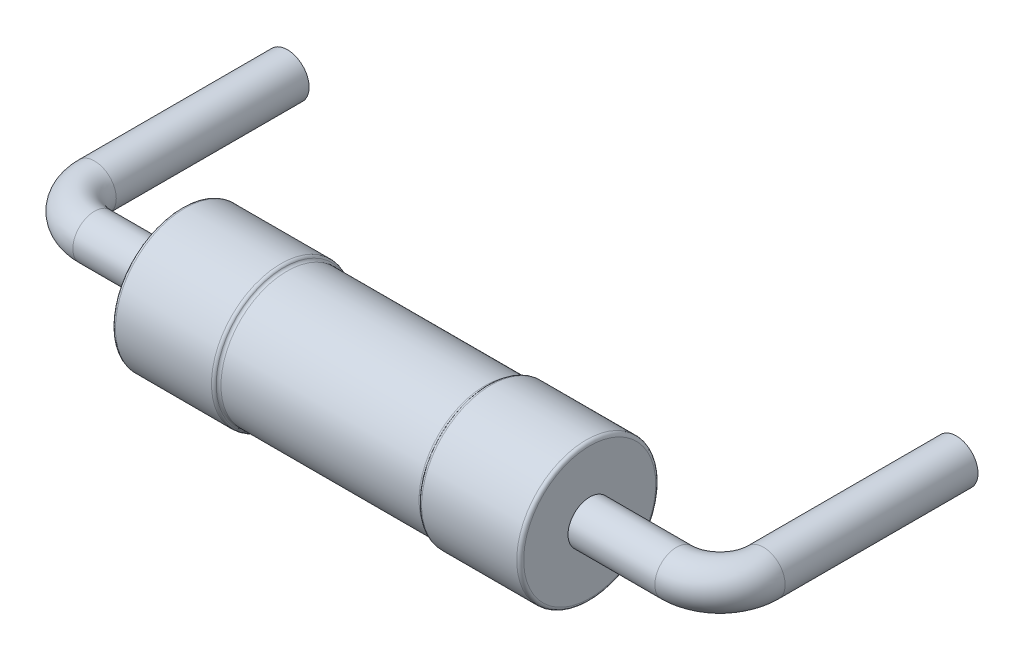
ISO-10303-21;
HEADER;
FILE_DESCRIPTION(('STEP AP214'),'2;1');
FILE_NAME('part.step','',(''),(''),'','','');
FILE_SCHEMA(('AUTOMOTIVE_DESIGN { 1 0 10303 214 1 1 1 1 }'));
ENDSEC;
DATA;
#1=APPLICATION_CONTEXT('core data for automotive mechanical design processes');
#2=APPLICATION_PROTOCOL_DEFINITION('international standard','automotive_design',2000,#1);
#3=PRODUCT_CONTEXT('',#1,'mechanical');
#4=PRODUCT('Part','Part','',(#3));
#5=PRODUCT_RELATED_PRODUCT_CATEGORY('part','',(#4));
#6=PRODUCT_DEFINITION_FORMATION('','',#4);
#7=PRODUCT_DEFINITION_CONTEXT('part definition',#1,'design');
#8=PRODUCT_DEFINITION('design','',#6,#7);
#9=PRODUCT_DEFINITION_SHAPE('','',#8);
#10=(LENGTH_UNIT() NAMED_UNIT(*) SI_UNIT(.MILLI.,.METRE.));
#11=(NAMED_UNIT(*) PLANE_ANGLE_UNIT() SI_UNIT($,.RADIAN.));
#12=(NAMED_UNIT(*) SI_UNIT($,.STERADIAN.) SOLID_ANGLE_UNIT());
#13=UNCERTAINTY_MEASURE_WITH_UNIT(LENGTH_MEASURE(1.E-05),#10,'distance_accuracy_value','');
#14=(GEOMETRIC_REPRESENTATION_CONTEXT(3) GLOBAL_UNCERTAINTY_ASSIGNED_CONTEXT((#13)) GLOBAL_UNIT_ASSIGNED_CONTEXT((#10,
#11,#12)) REPRESENTATION_CONTEXT('',''));
#15=CARTESIAN_POINT('',(0.,0.,0.));
#16=DIRECTION('',(0.,0.,1.));
#17=DIRECTION('',(1.,0.,0.));
#18=AXIS2_PLACEMENT_3D('',#15,#16,#17);
#19=CARTESIAN_POINT('',(-3.599,-0.251,0.));
#20=DIRECTION('',(0.,0.,-1.));
#21=DIRECTION('',(-1.,0.,0.));
#22=AXIS2_PLACEMENT_3D('',#19,#20,#21);
#23=PLANE('',#22);
#24=CARTESIAN_POINT('',(-3.85,0.,0.));
#25=DIRECTION('',(0.,0.,-1.));
#26=DIRECTION('',(-1.,0.,0.));
#27=AXIS2_PLACEMENT_3D('',#24,#25,#26);
#28=CIRCLE('',#27,0.25);
#29=CARTESIAN_POINT('',(-4.1,0.,0.));
#30=VERTEX_POINT('',#29);
#31=EDGE_CURVE('E73',#30,#30,#28,.F.);
#32=ORIENTED_EDGE('',*,*,#31,.F.);
#33=EDGE_LOOP('',(#32));
#34=FACE_BOUND('',#33,.T.);
#35=ADVANCED_FACE('F14',(#34),#23,.T.);
#36=CARTESIAN_POINT('',(-3.85,0.,2.22));
#37=DIRECTION('',(0.,0.,-1.));
#38=DIRECTION('',(-1.,0.,0.));
#39=AXIS2_PLACEMENT_3D('',#36,#37,#38);
#40=CYLINDRICAL_SURFACE('',#39,0.25);
#41=ORIENTED_EDGE('',*,*,#31,.T.);
#42=EDGE_LOOP('',(#41));
#43=FACE_BOUND('',#42,.T.);
#44=CARTESIAN_POINT('',(-3.85,0.,2.22));
#45=DIRECTION('',(0.,0.,1.));
#46=DIRECTION('',(1.,0.,0.));
#47=AXIS2_PLACEMENT_3D('',#44,#45,#46);
#48=CIRCLE('',#47,0.25);
#49=CARTESIAN_POINT('',(-3.6,0.,2.22));
#50=VERTEX_POINT('',#49);
#51=EDGE_CURVE('E69',#50,#50,#48,.T.);
#52=ORIENTED_EDGE('',*,*,#51,.F.);
#53=EDGE_LOOP('',(#52));
#54=FACE_BOUND('',#53,.T.);
#55=ADVANCED_FACE('F94',(#43,#54),#40,.T.);
#56=CARTESIAN_POINT('',(-3.35,0.,2.22));
#57=DIRECTION('',(0.,1.,0.));
#58=DIRECTION('',(0.,0.,1.));
#59=AXIS2_PLACEMENT_3D('',#56,#57,#58);
#60=TOROIDAL_SURFACE('',#59,0.5,0.25);
#61=ORIENTED_EDGE('',*,*,#51,.T.);
#62=EDGE_LOOP('',(#61));
#63=FACE_BOUND('',#62,.T.);
#64=CARTESIAN_POINT('',(-3.35,0.,2.72));
#65=DIRECTION('',(1.,0.,0.));
#66=DIRECTION('',(0.,0.,-1.));
#67=AXIS2_PLACEMENT_3D('',#64,#65,#66);
#68=CIRCLE('',#67,0.25);
#69=CARTESIAN_POINT('',(-3.35,0.,2.47));
#70=VERTEX_POINT('',#69);
#71=EDGE_CURVE('E72',#70,#70,#68,.T.);
#72=ORIENTED_EDGE('',*,*,#71,.F.);
#73=EDGE_LOOP('',(#72));
#74=FACE_BOUND('',#73,.T.);
#75=ADVANCED_FACE('F92',(#63,#74),#60,.T.);
#76=CARTESIAN_POINT('',(-2.35,0.,2.72));
#77=DIRECTION('',(-1.,0.,0.));
#78=DIRECTION('',(0.,0.,1.));
#79=AXIS2_PLACEMENT_3D('',#76,#77,#78);
#80=CYLINDRICAL_SURFACE('',#79,0.25);
#81=ORIENTED_EDGE('',*,*,#71,.T.);
#82=EDGE_LOOP('',(#81));
#83=FACE_BOUND('',#82,.T.);
#84=CARTESIAN_POINT('',(-2.35,0.,2.72));
#85=DIRECTION('',(-1.,0.,0.));
#86=DIRECTION('',(0.,0.,1.));
#87=AXIS2_PLACEMENT_3D('',#84,#85,#86);
#88=CIRCLE('',#87,0.25);
#89=CARTESIAN_POINT('',(-2.35,0.,2.97));
#90=VERTEX_POINT('',#89);
#91=EDGE_CURVE('E82',#90,#90,#88,.F.);
#92=ORIENTED_EDGE('',*,*,#91,.F.);
#93=EDGE_LOOP('',(#92));
#94=FACE_BOUND('',#93,.T.);
#95=ADVANCED_FACE('F89',(#83,#94),#80,.T.);
#96=CARTESIAN_POINT('',(-2.35,-0.761,1.959));
#97=DIRECTION('',(-1.,0.,0.));
#98=DIRECTION('',(0.,0.,1.));
#99=AXIS2_PLACEMENT_3D('',#96,#97,#98);
#100=PLANE('',#99);
#101=ORIENTED_EDGE('',*,*,#91,.T.);
#102=EDGE_LOOP('',(#101));
#103=FACE_BOUND('',#102,.T.);
#104=CARTESIAN_POINT('',(-2.35,0.,2.72));
#105=DIRECTION('',(-1.,0.,0.));
#106=DIRECTION('',(0.,0.,1.));
#107=AXIS2_PLACEMENT_3D('',#104,#105,#106);
#108=CIRCLE('',#107,0.760000000001124);
#109=CARTESIAN_POINT('',(-2.35,0.,3.48000000000112));
#110=VERTEX_POINT('',#109);
#111=EDGE_CURVE('E68',#110,#110,#108,.F.);
#112=ORIENTED_EDGE('',*,*,#111,.F.);
#113=EDGE_LOOP('',(#112));
#114=FACE_BOUND('',#113,.T.);
#115=ADVANCED_FACE('F102',(#103,#114),#100,.T.);
#116=CARTESIAN_POINT('',(-2.31,0.,2.72));
#117=DIRECTION('',(-1.,0.,0.));
#118=DIRECTION('',(0.,0.,1.));
#119=AXIS2_PLACEMENT_3D('',#116,#117,#118);
#120=TOROIDAL_SURFACE('',#119,0.76,0.0399999999999999);
#121=CARTESIAN_POINT('',(-2.31,0.,2.72));
#122=DIRECTION('',(1.,0.,0.));
#123=DIRECTION('',(0.,0.,-1.));
#124=AXIS2_PLACEMENT_3D('',#121,#122,#123);
#125=CIRCLE('',#124,0.8);
#126=CARTESIAN_POINT('',(-2.31,0.,1.92));
#127=VERTEX_POINT('',#126);
#128=EDGE_CURVE('E63',#127,#127,#125,.T.);
#129=ORIENTED_EDGE('',*,*,#128,.F.);
#130=EDGE_LOOP('',(#129));
#131=FACE_BOUND('',#130,.T.);
#132=ORIENTED_EDGE('',*,*,#111,.T.);
#133=EDGE_LOOP('',(#132));
#134=FACE_BOUND('',#133,.T.);
#135=ADVANCED_FACE('F160',(#131,#134),#120,.T.);
#136=CARTESIAN_POINT('',(-1.20428203230276,0.,2.72));
#137=DIRECTION('',(-1.,0.,0.));
#138=DIRECTION('',(0.,0.,1.));
#139=AXIS2_PLACEMENT_3D('',#136,#137,#138);
#140=CYLINDRICAL_SURFACE('',#139,0.8);
#141=ORIENTED_EDGE('',*,*,#128,.T.);
#142=EDGE_LOOP('',(#141));
#143=FACE_BOUND('',#142,.T.);
#144=CARTESIAN_POINT('',(-1.20428203230276,0.,2.72));
#145=DIRECTION('',(1.,0.,0.));
#146=DIRECTION('',(0.,0.,-1.));
#147=AXIS2_PLACEMENT_3D('',#144,#145,#146);
#148=CIRCLE('',#147,0.8);
#149=CARTESIAN_POINT('',(-1.20428203230276,0.,1.92));
#150=VERTEX_POINT('',#149);
#151=EDGE_CURVE('E60',#150,#150,#148,.T.);
#152=ORIENTED_EDGE('',*,*,#151,.F.);
#153=EDGE_LOOP('',(#152));
#154=FACE_BOUND('',#153,.T.);
#155=ADVANCED_FACE('F156',(#143,#154),#140,.T.);
#156=CARTESIAN_POINT('',(-1.20428203230276,0.,2.72));
#157=DIRECTION('',(1.,0.,0.));
#158=DIRECTION('',(0.,0.,-1.));
#159=AXIS2_PLACEMENT_3D('',#156,#157,#158);
#160=TOROIDAL_SURFACE('',#159,0.760000000000002,0.0400000000000002);
#161=ORIENTED_EDGE('',*,*,#151,.T.);
#162=EDGE_LOOP('',(#161));
#163=FACE_BOUND('',#162,.T.);
#164=CARTESIAN_POINT('',(-1.16964101615138,0.,2.72));
#165=DIRECTION('',(1.,0.,0.));
#166=DIRECTION('',(0.,0.,-1.));
#167=AXIS2_PLACEMENT_3D('',#164,#165,#166);
#168=CIRCLE('',#167,0.780000000000001);
#169=CARTESIAN_POINT('',(-1.16964101615138,0.,1.94));
#170=VERTEX_POINT('',#169);
#171=EDGE_CURVE('E57',#170,#170,#168,.T.);
#172=ORIENTED_EDGE('',*,*,#171,.F.);
#173=EDGE_LOOP('',(#172));
#174=FACE_BOUND('',#173,.T.);
#175=ADVANCED_FACE('F152',(#163,#174),#160,.T.);
#176=CARTESIAN_POINT('',(-1.135,0.,2.72));
#177=DIRECTION('',(-1.,0.,0.));
#178=DIRECTION('',(0.,0.,1.));
#179=AXIS2_PLACEMENT_3D('',#176,#177,#178);
#180=TOROIDAL_SURFACE('',#179,0.799999999999998,0.0399999999999991);
#181=CARTESIAN_POINT('',(-1.135,0.,2.72));
#182=DIRECTION('',(1.,0.,0.));
#183=DIRECTION('',(0.,0.,-1.));
#184=AXIS2_PLACEMENT_3D('',#181,#182,#183);
#185=CIRCLE('',#184,0.76);
#186=CARTESIAN_POINT('',(-1.135,0.,1.96));
#187=VERTEX_POINT('',#186);
#188=EDGE_CURVE('E52',#187,#187,#185,.T.);
#189=ORIENTED_EDGE('',*,*,#188,.F.);
#190=EDGE_LOOP('',(#189));
#191=FACE_BOUND('',#190,.T.);
#192=ORIENTED_EDGE('',*,*,#171,.T.);
#193=EDGE_LOOP('',(#192));
#194=FACE_BOUND('',#193,.T.);
#195=ADVANCED_FACE('F148',(#191,#194),#180,.F.);
#196=CARTESIAN_POINT('',(1.14571796769725,0.,2.72));
#197=DIRECTION('',(-1.,0.,0.));
#198=DIRECTION('',(0.,0.,1.));
#199=AXIS2_PLACEMENT_3D('',#196,#197,#198);
#200=CYLINDRICAL_SURFACE('',#199,0.76);
#201=ORIENTED_EDGE('',*,*,#188,.T.);
#202=EDGE_LOOP('',(#201));
#203=FACE_BOUND('',#202,.T.);
#204=CARTESIAN_POINT('',(1.14571796769725,0.,2.72));
#205=DIRECTION('',(1.,0.,0.));
#206=DIRECTION('',(0.,0.,-1.));
#207=AXIS2_PLACEMENT_3D('',#204,#205,#206);
#208=CIRCLE('',#207,0.76);
#209=CARTESIAN_POINT('',(1.14571796769725,0.,1.96));
#210=VERTEX_POINT('',#209);
#211=EDGE_CURVE('E49',#210,#210,#208,.T.);
#212=ORIENTED_EDGE('',*,*,#211,.F.);
#213=EDGE_LOOP('',(#212));
#214=FACE_BOUND('',#213,.T.);
#215=ADVANCED_FACE('F144',(#203,#214),#200,.T.);
#216=CARTESIAN_POINT('',(1.14571796769725,0.,2.72));
#217=DIRECTION('',(1.,0.,0.));
#218=DIRECTION('',(0.,0.,-1.));
#219=AXIS2_PLACEMENT_3D('',#216,#217,#218);
#220=TOROIDAL_SURFACE('',#219,0.800000000000016,0.0400000000000135);
#221=ORIENTED_EDGE('',*,*,#211,.T.);
#222=EDGE_LOOP('',(#221));
#223=FACE_BOUND('',#222,.T.);
#224=CARTESIAN_POINT('',(1.18035898384862,0.,2.72));
#225=DIRECTION('',(1.,0.,0.));
#226=DIRECTION('',(0.,0.,-1.));
#227=AXIS2_PLACEMENT_3D('',#224,#225,#226);
#228=CIRCLE('',#227,0.78);
#229=CARTESIAN_POINT('',(1.18035898384862,0.,1.94));
#230=VERTEX_POINT('',#229);
#231=EDGE_CURVE('E46',#230,#230,#228,.T.);
#232=ORIENTED_EDGE('',*,*,#231,.F.);
#233=EDGE_LOOP('',(#232));
#234=FACE_BOUND('',#233,.T.);
#235=ADVANCED_FACE('F140',(#223,#234),#220,.F.);
#236=CARTESIAN_POINT('',(1.215,0.,2.72));
#237=DIRECTION('',(-1.,0.,0.));
#238=DIRECTION('',(0.,0.,1.));
#239=AXIS2_PLACEMENT_3D('',#236,#237,#238);
#240=TOROIDAL_SURFACE('',#239,0.760000000000004,0.0399999999999979);
#241=CARTESIAN_POINT('',(1.215,0.,2.72));
#242=DIRECTION('',(1.,0.,0.));
#243=DIRECTION('',(0.,0.,-1.));
#244=AXIS2_PLACEMENT_3D('',#241,#242,#243);
#245=CIRCLE('',#244,0.8);
#246=CARTESIAN_POINT('',(1.215,0.,1.92));
#247=VERTEX_POINT('',#246);
#248=EDGE_CURVE('E41',#247,#247,#245,.T.);
#249=ORIENTED_EDGE('',*,*,#248,.F.);
#250=EDGE_LOOP('',(#249));
#251=FACE_BOUND('',#250,.T.);
#252=ORIENTED_EDGE('',*,*,#231,.T.);
#253=EDGE_LOOP('',(#252));
#254=FACE_BOUND('',#253,.T.);
#255=ADVANCED_FACE('F136',(#251,#254),#240,.T.);
#256=CARTESIAN_POINT('',(2.31,0.,2.72));
#257=DIRECTION('',(-1.,0.,0.));
#258=DIRECTION('',(0.,0.,1.));
#259=AXIS2_PLACEMENT_3D('',#256,#257,#258);
#260=CYLINDRICAL_SURFACE('',#259,0.8);
#261=ORIENTED_EDGE('',*,*,#248,.T.);
#262=EDGE_LOOP('',(#261));
#263=FACE_BOUND('',#262,.T.);
#264=CARTESIAN_POINT('',(2.31,0.,2.72));
#265=DIRECTION('',(1.,0.,0.));
#266=DIRECTION('',(0.,0.,-1.));
#267=AXIS2_PLACEMENT_3D('',#264,#265,#266);
#268=CIRCLE('',#267,0.8);
#269=CARTESIAN_POINT('',(2.31,0.,1.92));
#270=VERTEX_POINT('',#269);
#271=EDGE_CURVE('E37',#270,#270,#268,.T.);
#272=ORIENTED_EDGE('',*,*,#271,.F.);
#273=EDGE_LOOP('',(#272));
#274=FACE_BOUND('',#273,.T.);
#275=ADVANCED_FACE('F132',(#263,#274),#260,.T.);
#276=CARTESIAN_POINT('',(2.31,0.,2.72));
#277=DIRECTION('',(1.,0.,0.));
#278=DIRECTION('',(0.,0.,-1.));
#279=AXIS2_PLACEMENT_3D('',#276,#277,#278);
#280=TOROIDAL_SURFACE('',#279,0.76,0.0400000000000003);
#281=ORIENTED_EDGE('',*,*,#271,.T.);
#282=EDGE_LOOP('',(#281));
#283=FACE_BOUND('',#282,.T.);
#284=CARTESIAN_POINT('',(2.35,0.,2.72));
#285=DIRECTION('',(1.,0.,0.));
#286=DIRECTION('',(0.,0.,-1.));
#287=AXIS2_PLACEMENT_3D('',#284,#285,#286);
#288=CIRCLE('',#287,0.76);
#289=CARTESIAN_POINT('',(2.35,0.,1.96));
#290=VERTEX_POINT('',#289);
#291=EDGE_CURVE('E40',#290,#290,#288,.T.);
#292=ORIENTED_EDGE('',*,*,#291,.F.);
#293=EDGE_LOOP('',(#292));
#294=FACE_BOUND('',#293,.T.);
#295=ADVANCED_FACE('F128',(#283,#294),#280,.T.);
#296=CARTESIAN_POINT('',(2.35,-0.761,3.481));
#297=DIRECTION('',(1.,0.,0.));
#298=DIRECTION('',(0.,0.,-1.));
#299=AXIS2_PLACEMENT_3D('',#296,#297,#298);
#300=PLANE('',#299);
#301=CARTESIAN_POINT('',(2.35,0.,2.72));
#302=DIRECTION('',(-1.,0.,0.));
#303=DIRECTION('',(0.,0.,1.));
#304=AXIS2_PLACEMENT_3D('',#301,#302,#303);
#305=CIRCLE('',#304,0.25);
#306=CARTESIAN_POINT('',(2.35,0.,2.97));
#307=VERTEX_POINT('',#306);
#308=EDGE_CURVE('E34',#307,#307,#305,.F.);
#309=ORIENTED_EDGE('',*,*,#308,.F.);
#310=EDGE_LOOP('',(#309));
#311=FACE_BOUND('',#310,.T.);
#312=ORIENTED_EDGE('',*,*,#291,.T.);
#313=EDGE_LOOP('',(#312));
#314=FACE_BOUND('',#313,.T.);
#315=ADVANCED_FACE('F122',(#311,#314),#300,.T.);
#316=CARTESIAN_POINT('',(3.35,0.,2.72));
#317=DIRECTION('',(-1.,0.,0.));
#318=DIRECTION('',(0.,0.,1.));
#319=AXIS2_PLACEMENT_3D('',#316,#317,#318);
#320=CYLINDRICAL_SURFACE('',#319,0.25);
#321=ORIENTED_EDGE('',*,*,#308,.T.);
#322=EDGE_LOOP('',(#321));
#323=FACE_BOUND('',#322,.T.);
#324=CARTESIAN_POINT('',(3.35,0.,2.72));
#325=DIRECTION('',(1.,0.,0.));
#326=DIRECTION('',(0.,0.,-1.));
#327=AXIS2_PLACEMENT_3D('',#324,#325,#326);
#328=CIRCLE('',#327,0.25);
#329=CARTESIAN_POINT('',(3.35,0.,2.47));
#330=VERTEX_POINT('',#329);
#331=EDGE_CURVE('E27',#330,#330,#328,.T.);
#332=ORIENTED_EDGE('',*,*,#331,.F.);
#333=EDGE_LOOP('',(#332));
#334=FACE_BOUND('',#333,.T.);
#335=ADVANCED_FACE('F117',(#323,#334),#320,.T.);
#336=CARTESIAN_POINT('',(4.101,-0.251,0.));
#337=DIRECTION('',(0.,0.,-1.));
#338=DIRECTION('',(-1.,0.,0.));
#339=AXIS2_PLACEMENT_3D('',#336,#337,#338);
#340=PLANE('',#339);
#341=CARTESIAN_POINT('',(3.85,0.,0.));
#342=DIRECTION('',(0.,0.,1.));
#343=DIRECTION('',(1.,0.,0.));
#344=AXIS2_PLACEMENT_3D('',#341,#342,#343);
#345=CIRCLE('',#344,0.25);
#346=CARTESIAN_POINT('',(4.1,0.,0.));
#347=VERTEX_POINT('',#346);
#348=EDGE_CURVE('E22',#347,#347,#345,.T.);
#349=ORIENTED_EDGE('',*,*,#348,.F.);
#350=EDGE_LOOP('',(#349));
#351=FACE_BOUND('',#350,.T.);
#352=ADVANCED_FACE('F111',(#351),#340,.T.);
#353=CARTESIAN_POINT('',(3.35,0.,2.22));
#354=DIRECTION('',(0.,1.,0.));
#355=DIRECTION('',(0.,0.,1.));
#356=AXIS2_PLACEMENT_3D('',#353,#354,#355);
#357=TOROIDAL_SURFACE('',#356,0.5,0.25);
#358=ORIENTED_EDGE('',*,*,#331,.T.);
#359=EDGE_LOOP('',(#358));
#360=FACE_BOUND('',#359,.T.);
#361=CARTESIAN_POINT('',(3.85,0.,2.22));
#362=DIRECTION('',(0.,0.,-1.));
#363=DIRECTION('',(-1.,0.,0.));
#364=AXIS2_PLACEMENT_3D('',#361,#362,#363);
#365=CIRCLE('',#364,0.25);
#366=CARTESIAN_POINT('',(3.6,0.,2.22));
#367=VERTEX_POINT('',#366);
#368=EDGE_CURVE('E10',#367,#367,#365,.T.);
#369=ORIENTED_EDGE('',*,*,#368,.F.);
#370=EDGE_LOOP('',(#369));
#371=FACE_BOUND('',#370,.T.);
#372=ADVANCED_FACE('F107',(#360,#371),#357,.T.);
#373=CARTESIAN_POINT('',(3.85,0.,0.));
#374=DIRECTION('',(0.,0.,1.));
#375=DIRECTION('',(1.,0.,0.));
#376=AXIS2_PLACEMENT_3D('',#373,#374,#375);
#377=CYLINDRICAL_SURFACE('',#376,0.25);
#378=ORIENTED_EDGE('',*,*,#368,.T.);
#379=EDGE_LOOP('',(#378));
#380=FACE_BOUND('',#379,.T.);
#381=ORIENTED_EDGE('',*,*,#348,.T.);
#382=EDGE_LOOP('',(#381));
#383=FACE_BOUND('',#382,.T.);
#384=ADVANCED_FACE('F16',(#380,#383),#377,.T.);
#385=CLOSED_SHELL('',(#35,#55,#75,#95,#115,#135,#155,#175,#195,#215,#235,#255,#275,#295,#315,
#335,#352,#372,#384));
#386=MANIFOLD_SOLID_BREP('B1',#385);
#387=ADVANCED_BREP_SHAPE_REPRESENTATION('',(#18,#386),#14);
#388=SHAPE_DEFINITION_REPRESENTATION(#9,#387);
ENDSEC;
END-ISO-10303-21;
